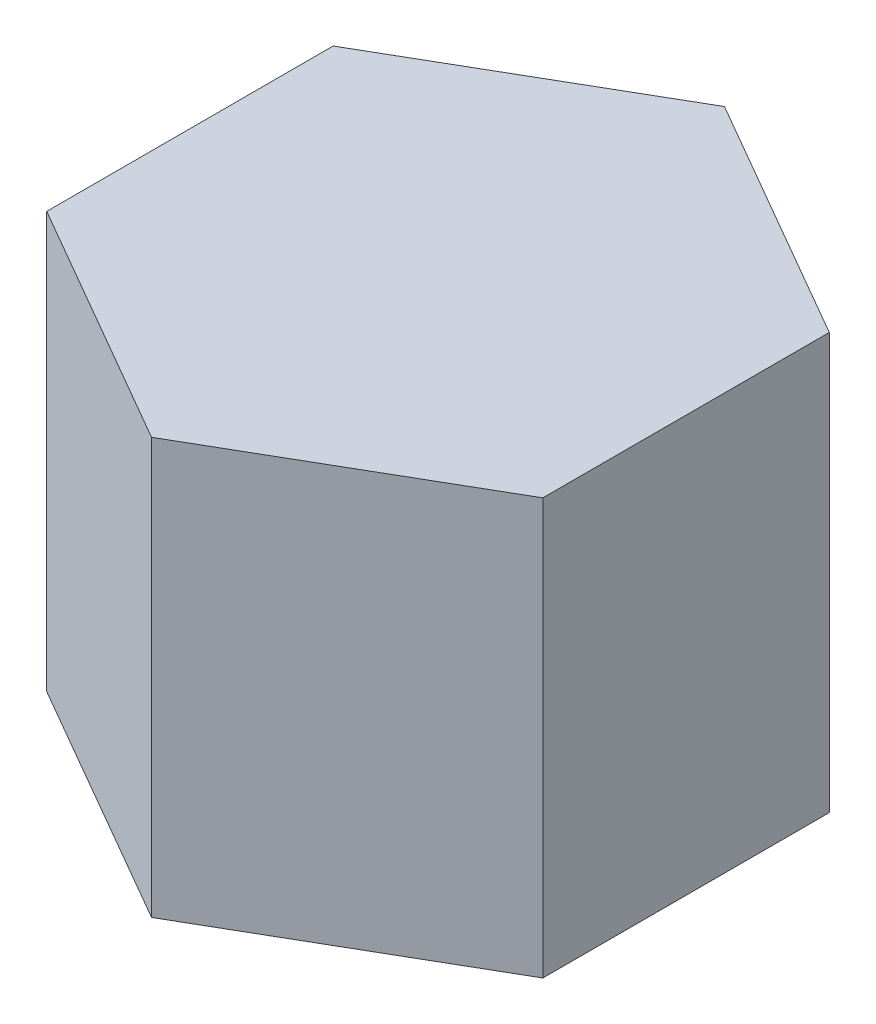
ISO-10303-21;
HEADER;
FILE_DESCRIPTION(('STEP AP214'),'2;1');
FILE_NAME('part.step','',(''),(''),'','','');
FILE_SCHEMA(('AUTOMOTIVE_DESIGN { 1 0 10303 214 1 1 1 1 }'));
ENDSEC;
DATA;
#1=APPLICATION_CONTEXT('core data for automotive mechanical design processes');
#2=APPLICATION_PROTOCOL_DEFINITION('international standard','automotive_design',2000,#1);
#3=PRODUCT_CONTEXT('',#1,'mechanical');
#4=PRODUCT('Part','Part','',(#3));
#5=PRODUCT_RELATED_PRODUCT_CATEGORY('part','',(#4));
#6=PRODUCT_DEFINITION_FORMATION('','',#4);
#7=PRODUCT_DEFINITION_CONTEXT('part definition',#1,'design');
#8=PRODUCT_DEFINITION('design','',#6,#7);
#9=PRODUCT_DEFINITION_SHAPE('','',#8);
#10=(LENGTH_UNIT() NAMED_UNIT(*) SI_UNIT(.MILLI.,.METRE.));
#11=(NAMED_UNIT(*) PLANE_ANGLE_UNIT() SI_UNIT($,.RADIAN.));
#12=(NAMED_UNIT(*) SI_UNIT($,.STERADIAN.) SOLID_ANGLE_UNIT());
#13=UNCERTAINTY_MEASURE_WITH_UNIT(LENGTH_MEASURE(1.E-05),#10,'distance_accuracy_value','');
#14=(GEOMETRIC_REPRESENTATION_CONTEXT(3) GLOBAL_UNCERTAINTY_ASSIGNED_CONTEXT((#13)) GLOBAL_UNIT_ASSIGNED_CONTEXT((#10,
#11,#12)) REPRESENTATION_CONTEXT('',''));
#15=CARTESIAN_POINT('',(0.,0.,0.));
#16=DIRECTION('',(0.,0.,1.));
#17=DIRECTION('',(1.,0.,0.));
#18=AXIS2_PLACEMENT_3D('',#15,#16,#17);
#19=CARTESIAN_POINT('',(203.642660308706,-148.537700895744,291.506971220494));
#20=DIRECTION('',(-0.499999999999909,0.,-0.866025403784491));
#21=DIRECTION('',(-0.866025403784491,0.,0.499999999999909));
#22=AXIS2_PLACEMENT_3D('',#19,#20,#21);
#23=PLANE('',#22);
#24=CARTESIAN_POINT('',(203.339551417382,-149.045793579175,291.681971220494));
#25=DIRECTION('',(0.866025403784491,0.,-0.499999999999909));
#26=VECTOR('',#25,1.);
#27=LINE('',#24,#26);
#28=CARTESIAN_POINT('',(203.339551417382,-149.045793579175,291.681971220494));
#29=VERTEX_POINT('',#28);
#30=CARTESIAN_POINT('',(203.642660308706,-149.045793579175,291.506971220494));
#31=VERTEX_POINT('',#30);
#32=EDGE_CURVE('E170',#29,#31,#27,.T.);
#33=ORIENTED_EDGE('',*,*,#32,.T.);
#34=CARTESIAN_POINT('',(203.642660308706,-148.537700895744,291.506971220494));
#35=DIRECTION('',(0.,-1.,0.));
#36=VECTOR('',#35,1.);
#37=LINE('',#34,#36);
#38=CARTESIAN_POINT('',(203.642660308706,-148.537700895744,291.506971220494));
#39=VERTEX_POINT('',#38);
#40=EDGE_CURVE('E35',#39,#31,#37,.T.);
#41=ORIENTED_EDGE('',*,*,#40,.F.);
#42=CARTESIAN_POINT('',(203.339551417382,-148.537700895744,291.681971220494));
#43=DIRECTION('',(0.866025403784491,0.,-0.499999999999909));
#44=VECTOR('',#43,1.);
#45=LINE('',#42,#44);
#46=CARTESIAN_POINT('',(203.339551417382,-148.537700895744,291.681971220494));
#47=VERTEX_POINT('',#46);
#48=EDGE_CURVE('E159',#47,#39,#45,.T.);
#49=ORIENTED_EDGE('',*,*,#48,.F.);
#50=CARTESIAN_POINT('',(203.339551417382,-148.537700895744,291.681971220494));
#51=DIRECTION('',(0.,-1.,0.));
#52=VECTOR('',#51,1.);
#53=LINE('',#50,#52);
#54=EDGE_CURVE('E10',#47,#29,#53,.T.);
#55=ORIENTED_EDGE('',*,*,#54,.T.);
#56=EDGE_LOOP('',(#33,#41,#49,#55));
#57=FACE_BOUND('',#56,.T.);
#58=ADVANCED_FACE('F16',(#57),#23,.F.);
#59=CARTESIAN_POINT('',(203.339551417382,-148.537700895744,291.681971220494));
#60=DIRECTION('',(0.500000000000062,0.,-0.866025403784403));
#61=DIRECTION('',(-0.866025403784403,0.,-0.500000000000062));
#62=AXIS2_PLACEMENT_3D('',#59,#60,#61);
#63=PLANE('',#62);
#64=CARTESIAN_POINT('',(203.036442526057,-149.045793579175,291.506971220494));
#65=DIRECTION('',(0.866025403784403,0.,0.500000000000062));
#66=VECTOR('',#65,1.);
#67=LINE('',#64,#66);
#68=CARTESIAN_POINT('',(203.036442526057,-149.045793579175,291.506971220494));
#69=VERTEX_POINT('',#68);
#70=EDGE_CURVE('E167',#69,#29,#67,.T.);
#71=ORIENTED_EDGE('',*,*,#70,.T.);
#72=ORIENTED_EDGE('',*,*,#54,.F.);
#73=CARTESIAN_POINT('',(203.036442526057,-148.537700895744,291.506971220494));
#74=DIRECTION('',(0.866025403784403,0.,0.500000000000062));
#75=VECTOR('',#74,1.);
#76=LINE('',#73,#75);
#77=CARTESIAN_POINT('',(203.036442526057,-148.537700895744,291.506971220494));
#78=VERTEX_POINT('',#77);
#79=EDGE_CURVE('E156',#78,#47,#76,.T.);
#80=ORIENTED_EDGE('',*,*,#79,.F.);
#81=CARTESIAN_POINT('',(203.036442526057,-148.537700895744,291.506971220494));
#82=DIRECTION('',(0.,-1.,0.));
#83=VECTOR('',#82,1.);
#84=LINE('',#81,#83);
#85=EDGE_CURVE('E27',#78,#69,#84,.T.);
#86=ORIENTED_EDGE('',*,*,#85,.T.);
#87=EDGE_LOOP('',(#71,#72,#80,#86));
#88=FACE_BOUND('',#87,.T.);
#89=ADVANCED_FACE('F189',(#88),#63,.F.);
#90=CARTESIAN_POINT('',(203.036442526057,-148.537700895744,290.831971220494));
#91=DIRECTION('',(1.,0.,0.));
#92=DIRECTION('',(0.,1.,0.));
#93=AXIS2_PLACEMENT_3D('',#90,#91,#92);
#94=PLANE('',#93);
#95=CARTESIAN_POINT('',(203.036442526057,-149.045793579175,291.156971220494));
#96=DIRECTION('',(0.,0.,1.));
#97=VECTOR('',#96,1.);
#98=LINE('',#95,#97);
#99=CARTESIAN_POINT('',(203.036442526057,-149.045793579175,291.156971220494));
#100=VERTEX_POINT('',#99);
#101=EDGE_CURVE('E163',#100,#69,#98,.T.);
#102=ORIENTED_EDGE('',*,*,#101,.T.);
#103=ORIENTED_EDGE('',*,*,#85,.F.);
#104=CARTESIAN_POINT('',(203.036442526057,-148.537700895744,291.156971220494));
#105=DIRECTION('',(0.,0.,1.));
#106=VECTOR('',#105,1.);
#107=LINE('',#104,#106);
#108=CARTESIAN_POINT('',(203.036442526057,-148.537700895744,291.156971220494));
#109=VERTEX_POINT('',#108);
#110=EDGE_CURVE('E106',#109,#78,#107,.T.);
#111=ORIENTED_EDGE('',*,*,#110,.F.);
#112=CARTESIAN_POINT('',(203.036442526057,-148.537700895744,291.156971220494));
#113=DIRECTION('',(0.,-1.,0.));
#114=VECTOR('',#113,1.);
#115=LINE('',#112,#114);
#116=EDGE_CURVE('E94',#109,#100,#115,.T.);
#117=ORIENTED_EDGE('',*,*,#116,.T.);
#118=EDGE_LOOP('',(#102,#103,#111,#117));
#119=FACE_BOUND('',#118,.T.);
#120=ADVANCED_FACE('F198',(#119),#94,.F.);
#121=CARTESIAN_POINT('',(203.036442526057,-148.537700895744,291.156971220494));
#122=DIRECTION('',(0.499999999999943,0.,0.866025403784472));
#123=DIRECTION('',(0.866025403784472,0.,-0.499999999999943));
#124=AXIS2_PLACEMENT_3D('',#121,#122,#123);
#125=PLANE('',#124);
#126=CARTESIAN_POINT('',(203.339551417382,-149.045793579175,290.981971220494));
#127=DIRECTION('',(-0.866025403784471,0.,0.499999999999943));
#128=VECTOR('',#127,1.);
#129=LINE('',#126,#128);
#130=CARTESIAN_POINT('',(203.339551417382,-149.045793579175,290.981971220494));
#131=VERTEX_POINT('',#130);
#132=EDGE_CURVE('E162',#131,#100,#129,.T.);
#133=ORIENTED_EDGE('',*,*,#132,.T.);
#134=ORIENTED_EDGE('',*,*,#116,.F.);
#135=CARTESIAN_POINT('',(203.339551417382,-148.537700895744,290.981971220494));
#136=DIRECTION('',(-0.866025403784471,0.,0.499999999999943));
#137=VECTOR('',#136,1.);
#138=LINE('',#135,#137);
#139=CARTESIAN_POINT('',(203.339551417382,-148.537700895744,290.981971220494));
#140=VERTEX_POINT('',#139);
#141=EDGE_CURVE('E98',#140,#109,#138,.T.);
#142=ORIENTED_EDGE('',*,*,#141,.F.);
#143=CARTESIAN_POINT('',(203.339551417382,-148.537700895744,290.981971220494));
#144=DIRECTION('',(0.,-1.,0.));
#145=VECTOR('',#144,1.);
#146=LINE('',#143,#145);
#147=EDGE_CURVE('E79',#140,#131,#146,.T.);
#148=ORIENTED_EDGE('',*,*,#147,.T.);
#149=EDGE_LOOP('',(#133,#134,#142,#148));
#150=FACE_BOUND('',#149,.T.);
#151=ADVANCED_FACE('F100',(#150),#125,.F.);
#152=CARTESIAN_POINT('',(203.339551417381,-148.537700895744,290.981971220494));
#153=DIRECTION('',(-0.500000000000062,0.,0.866025403784403));
#154=DIRECTION('',(0.866025403784403,0.,0.500000000000062));
#155=AXIS2_PLACEMENT_3D('',#152,#153,#154);
#156=PLANE('',#155);
#157=CARTESIAN_POINT('',(203.642660308706,-149.045793579175,291.156971220494));
#158=DIRECTION('',(-0.866025403784403,0.,-0.500000000000062));
#159=VECTOR('',#158,1.);
#160=LINE('',#157,#159);
#161=CARTESIAN_POINT('',(203.642660308706,-149.045793579175,291.156971220494));
#162=VERTEX_POINT('',#161);
#163=EDGE_CURVE('E88',#162,#131,#160,.T.);
#164=ORIENTED_EDGE('',*,*,#163,.T.);
#165=ORIENTED_EDGE('',*,*,#147,.F.);
#166=CARTESIAN_POINT('',(203.642660308706,-148.537700895744,291.156971220494));
#167=DIRECTION('',(-0.866025403784403,0.,-0.500000000000062));
#168=VECTOR('',#167,1.);
#169=LINE('',#166,#168);
#170=CARTESIAN_POINT('',(203.642660308706,-148.537700895744,291.156971220494));
#171=VERTEX_POINT('',#170);
#172=EDGE_CURVE('E84',#171,#140,#169,.T.);
#173=ORIENTED_EDGE('',*,*,#172,.F.);
#174=CARTESIAN_POINT('',(203.642660308706,-148.537700895744,291.156971220494));
#175=DIRECTION('',(0.,-1.,0.));
#176=VECTOR('',#175,1.);
#177=LINE('',#174,#176);
#178=EDGE_CURVE('E58',#171,#162,#177,.T.);
#179=ORIENTED_EDGE('',*,*,#178,.T.);
#180=EDGE_LOOP('',(#164,#165,#173,#179));
#181=FACE_BOUND('',#180,.T.);
#182=ADVANCED_FACE('F82',(#181),#156,.F.);
#183=CARTESIAN_POINT('',(203.642660308706,-148.537700895744,290.831971220494));
#184=DIRECTION('',(-1.,0.,0.));
#185=DIRECTION('',(0.,-1.,0.));
#186=AXIS2_PLACEMENT_3D('',#183,#184,#185);
#187=PLANE('',#186);
#188=CARTESIAN_POINT('',(203.642660308706,-149.045793579175,291.506971220494));
#189=DIRECTION('',(0.,0.,-1.));
#190=VECTOR('',#189,1.);
#191=LINE('',#188,#190);
#192=EDGE_CURVE('E160',#31,#162,#191,.T.);
#193=ORIENTED_EDGE('',*,*,#192,.T.);
#194=ORIENTED_EDGE('',*,*,#178,.F.);
#195=CARTESIAN_POINT('',(203.642660308706,-148.537700895744,291.506971220494));
#196=DIRECTION('',(0.,0.,-1.));
#197=VECTOR('',#196,1.);
#198=LINE('',#195,#197);
#199=EDGE_CURVE('E112',#39,#171,#198,.T.);
#200=ORIENTED_EDGE('',*,*,#199,.F.);
#201=ORIENTED_EDGE('',*,*,#40,.T.);
#202=EDGE_LOOP('',(#193,#194,#200,#201));
#203=FACE_BOUND('',#202,.T.);
#204=ADVANCED_FACE('F131',(#203),#187,.F.);
#205=CARTESIAN_POINT('',(206.339551417382,-148.537700895744,290.831971220494));
#206=DIRECTION('',(0.,-1.,0.));
#207=DIRECTION('',(1.,0.,0.));
#208=AXIS2_PLACEMENT_3D('',#205,#206,#207);
#209=PLANE('',#208);
#210=ORIENTED_EDGE('',*,*,#48,.T.);
#211=ORIENTED_EDGE('',*,*,#199,.T.);
#212=ORIENTED_EDGE('',*,*,#172,.T.);
#213=ORIENTED_EDGE('',*,*,#141,.T.);
#214=ORIENTED_EDGE('',*,*,#110,.T.);
#215=ORIENTED_EDGE('',*,*,#79,.T.);
#216=EDGE_LOOP('',(#210,#211,#212,#213,#214,#215));
#217=FACE_BOUND('',#216,.T.);
#218=ADVANCED_FACE('F111',(#217),#209,.F.);
#219=CARTESIAN_POINT('',(206.339551417382,-149.045793579175,290.831971220494));
#220=DIRECTION('',(0.,-1.,0.));
#221=DIRECTION('',(1.,0.,0.));
#222=AXIS2_PLACEMENT_3D('',#219,#220,#221);
#223=PLANE('',#222);
#224=ORIENTED_EDGE('',*,*,#32,.F.);
#225=ORIENTED_EDGE('',*,*,#70,.F.);
#226=ORIENTED_EDGE('',*,*,#101,.F.);
#227=ORIENTED_EDGE('',*,*,#132,.F.);
#228=ORIENTED_EDGE('',*,*,#163,.F.);
#229=ORIENTED_EDGE('',*,*,#192,.F.);
#230=EDGE_LOOP('',(#224,#225,#226,#227,#228,#229));
#231=FACE_BOUND('',#230,.T.);
#232=ADVANCED_FACE('F130',(#231),#223,.T.);
#233=CLOSED_SHELL('',(#58,#89,#120,#151,#182,#204,#218,#232));
#234=MANIFOLD_SOLID_BREP('B1',#233);
#235=ADVANCED_BREP_SHAPE_REPRESENTATION('',(#18,#234),#14);
#236=SHAPE_DEFINITION_REPRESENTATION(#9,#235);
ENDSEC;
END-ISO-10303-21;
